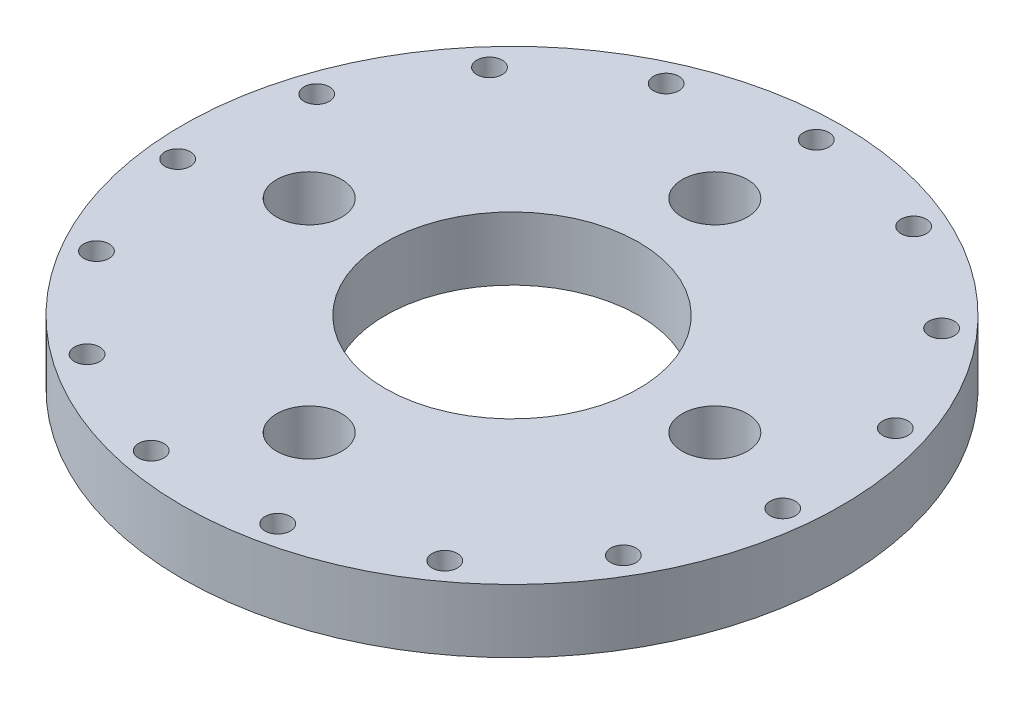
ISO-10303-21;
HEADER;
FILE_DESCRIPTION(('STEP AP214'),'2;1');
FILE_NAME('part.step','',(''),(''),'','','');
FILE_SCHEMA(('AUTOMOTIVE_DESIGN { 1 0 10303 214 1 1 1 1 }'));
ENDSEC;
DATA;
#1=APPLICATION_CONTEXT('core data for automotive mechanical design processes');
#2=APPLICATION_PROTOCOL_DEFINITION('international standard','automotive_design',2000,#1);
#3=PRODUCT_CONTEXT('',#1,'mechanical');
#4=PRODUCT('Part','Part','',(#3));
#5=PRODUCT_RELATED_PRODUCT_CATEGORY('part','',(#4));
#6=PRODUCT_DEFINITION_FORMATION('','',#4);
#7=PRODUCT_DEFINITION_CONTEXT('part definition',#1,'design');
#8=PRODUCT_DEFINITION('design','',#6,#7);
#9=PRODUCT_DEFINITION_SHAPE('','',#8);
#10=(LENGTH_UNIT() NAMED_UNIT(*) SI_UNIT(.MILLI.,.METRE.));
#11=(NAMED_UNIT(*) PLANE_ANGLE_UNIT() SI_UNIT($,.RADIAN.));
#12=(NAMED_UNIT(*) SI_UNIT($,.STERADIAN.) SOLID_ANGLE_UNIT());
#13=UNCERTAINTY_MEASURE_WITH_UNIT(LENGTH_MEASURE(1.E-05),#10,'distance_accuracy_value','');
#14=(GEOMETRIC_REPRESENTATION_CONTEXT(3) GLOBAL_UNCERTAINTY_ASSIGNED_CONTEXT((#13)) GLOBAL_UNIT_ASSIGNED_CONTEXT((#10,
#11,#12)) REPRESENTATION_CONTEXT('',''));
#15=CARTESIAN_POINT('',(0.,0.,0.));
#16=DIRECTION('',(0.,0.,1.));
#17=DIRECTION('',(1.,0.,0.));
#18=AXIS2_PLACEMENT_3D('',#15,#16,#17);
#19=CARTESIAN_POINT('',(0.,3.175,0.));
#20=DIRECTION('',(0.,1.,0.));
#21=DIRECTION('',(0.,0.,1.));
#22=AXIS2_PLACEMENT_3D('',#19,#20,#21);
#23=PLANE('',#22);
#24=CARTESIAN_POINT('',(6.19866644047502,3.175,-13.9224327744733));
#25=DIRECTION('',(0.,1.,0.));
#26=DIRECTION('',(-0.406736643075789,0.,0.913545457642606));
#27=AXIS2_PLACEMENT_3D('',#24,#25,#26);
#28=CIRCLE('',#27,0.635);
#29=CARTESIAN_POINT('',(5.9403886721219,3.175,-13.3423314088703));
#30=VERTEX_POINT('',#29);
#31=EDGE_CURVE('E158',#30,#30,#28,.T.);
#32=ORIENTED_EDGE('',*,*,#31,.F.);
#33=EDGE_LOOP('',(#32));
#34=FACE_BOUND('',#33,.T.);
#35=CARTESIAN_POINT('',(11.3255271402754,3.175,-10.1975504409091));
#36=DIRECTION('',(0.,1.,0.));
#37=DIRECTION('',(-0.743144825477386,0.,0.669130606358867));
#38=AXIS2_PLACEMENT_3D('',#35,#36,#37);
#39=CIRCLE('',#38,0.635);
#40=CARTESIAN_POINT('',(10.8536301760972,3.175,-9.77265250587125));
#41=VERTEX_POINT('',#40);
#42=EDGE_CURVE('E152',#41,#41,#39,.T.);
#43=ORIENTED_EDGE('',*,*,#42,.F.);
#44=EDGE_LOOP('',(#43));
#45=FACE_BOUND('',#44,.T.);
#46=CARTESIAN_POINT('',(14.4941013083381,3.175,-4.70941899427435));
#47=DIRECTION('',(0.,1.,0.));
#48=DIRECTION('',(-0.95105651629515,0.,0.309016994374957));
#49=AXIS2_PLACEMENT_3D('',#46,#47,#48);
#50=CIRCLE('',#49,0.635);
#51=CARTESIAN_POINT('',(13.8901804204907,3.175,-4.51319320284625));
#52=VERTEX_POINT('',#51);
#53=EDGE_CURVE('E146',#52,#52,#50,.T.);
#54=ORIENTED_EDGE('',*,*,#53,.F.);
#55=EDGE_LOOP('',(#54));
#56=FACE_BOUND('',#55,.T.);
#57=CARTESIAN_POINT('',(15.1565136854125,3.175,1.59301378019889));
#58=DIRECTION('',(0.,1.,0.));
#59=DIRECTION('',(-0.994521895368274,0.,-0.104528463267644));
#60=AXIS2_PLACEMENT_3D('',#57,#58,#59);
#61=CIRCLE('',#60,0.635);
#62=CARTESIAN_POINT('',(14.5249922818536,3.175,1.52663820602394));
#63=VERTEX_POINT('',#62);
#64=EDGE_CURVE('E140',#63,#63,#61,.T.);
#65=ORIENTED_EDGE('',*,*,#64,.F.);
#66=EDGE_LOOP('',(#65));
#67=FACE_BOUND('',#66,.T.);
#68=CARTESIAN_POINT('',(13.1982271536749,3.175,7.61999999999988));
#69=DIRECTION('',(0.,1.,0.));
#70=DIRECTION('',(-0.866025403784443,0.,-0.499999999999992));
#71=AXIS2_PLACEMENT_3D('',#68,#69,#70);
#72=CIRCLE('',#71,0.635);
#73=CARTESIAN_POINT('',(12.6483010222718,3.175,7.30249999999988));
#74=VERTEX_POINT('',#73);
#75=EDGE_CURVE('E134',#74,#74,#72,.T.);
#76=ORIENTED_EDGE('',*,*,#75,.F.);
#77=EDGE_LOOP('',(#76));
#78=FACE_BOUND('',#77,.T.);
#79=CARTESIAN_POINT('',(8.95784724493739,3.175,12.3294189942741));
#80=DIRECTION('',(0.,1.,0.));
#81=DIRECTION('',(-0.58778525229248,0.,-0.809016994374943));
#82=AXIS2_PLACEMENT_3D('',#79,#80,#81);
#83=CIRCLE('',#82,0.635);
#84=CARTESIAN_POINT('',(8.58460360973167,3.175,11.815693202846));
#85=VERTEX_POINT('',#84);
#86=EDGE_CURVE('E128',#85,#85,#83,.T.);
#87=ORIENTED_EDGE('',*,*,#86,.F.);
#88=EDGE_LOOP('',(#87));
#89=FACE_BOUND('',#88,.T.);
#90=CARTESIAN_POINT('',(3.16857416806276,3.175,14.9069694351832));
#91=DIRECTION('',(0.,1.,0.));
#92=DIRECTION('',(-0.207911690817766,0.,-0.978147600733804));
#93=AXIS2_PLACEMENT_3D('',#90,#91,#92);
#94=CIRCLE('',#93,0.635);
#95=CARTESIAN_POINT('',(3.03655024439348,3.175,14.2858457087172));
#96=VERTEX_POINT('',#95);
#97=EDGE_CURVE('E122',#96,#96,#94,.T.);
#98=ORIENTED_EDGE('',*,*,#97,.F.);
#99=EDGE_LOOP('',(#98));
#100=FACE_BOUND('',#99,.T.);
#101=CARTESIAN_POINT('',(-3.16857416806256,3.175,14.9069694351832));
#102=DIRECTION('',(0.,1.,0.));
#103=DIRECTION('',(0.207911690817753,0.,-0.978147600733807));
#104=AXIS2_PLACEMENT_3D('',#101,#102,#103);
#105=CIRCLE('',#104,0.635);
#106=CARTESIAN_POINT('',(-3.03655024439329,3.175,14.2858457087172));
#107=VERTEX_POINT('',#106);
#108=EDGE_CURVE('E116',#107,#107,#105,.T.);
#109=ORIENTED_EDGE('',*,*,#108,.F.);
#110=EDGE_LOOP('',(#109));
#111=FACE_BOUND('',#110,.T.);
#112=CARTESIAN_POINT('',(-8.95784724493723,3.175,12.3294189942742));
#113=DIRECTION('',(0.,1.,0.));
#114=DIRECTION('',(0.587785252292469,0.,-0.80901699437495));
#115=AXIS2_PLACEMENT_3D('',#112,#113,#114);
#116=CIRCLE('',#115,0.635);
#117=CARTESIAN_POINT('',(-8.58460360973151,3.175,11.8156932028461));
#118=VERTEX_POINT('',#117);
#119=EDGE_CURVE('E110',#118,#118,#116,.T.);
#120=ORIENTED_EDGE('',*,*,#119,.F.);
#121=EDGE_LOOP('',(#120));
#122=FACE_BOUND('',#121,.T.);
#123=CARTESIAN_POINT('',(-13.1982271536748,3.175,7.62000000000006));
#124=DIRECTION('',(0.,1.,0.));
#125=DIRECTION('',(0.866025403784436,0.,-0.500000000000004));
#126=AXIS2_PLACEMENT_3D('',#123,#124,#125);
#127=CIRCLE('',#126,0.635);
#128=CARTESIAN_POINT('',(-12.6483010222717,3.175,7.30250000000006));
#129=VERTEX_POINT('',#128);
#130=EDGE_CURVE('E104',#129,#129,#127,.T.);
#131=ORIENTED_EDGE('',*,*,#130,.F.);
#132=EDGE_LOOP('',(#131));
#133=FACE_BOUND('',#132,.T.);
#134=CARTESIAN_POINT('',(-15.1565136854125,3.175,1.59301378019909));
#135=DIRECTION('',(0.,1.,0.));
#136=DIRECTION('',(0.994521895368273,0.,-0.104528463267657));
#137=AXIS2_PLACEMENT_3D('',#134,#135,#136);
#138=CIRCLE('',#137,0.635);
#139=CARTESIAN_POINT('',(-14.5249922818536,3.175,1.52663820602413));
#140=VERTEX_POINT('',#139);
#141=EDGE_CURVE('E98',#140,#140,#138,.T.);
#142=ORIENTED_EDGE('',*,*,#141,.F.);
#143=EDGE_LOOP('',(#142));
#144=FACE_BOUND('',#143,.T.);
#145=CARTESIAN_POINT('',(-14.4941013083382,3.175,-4.70941899427416));
#146=DIRECTION('',(0.,1.,0.));
#147=DIRECTION('',(0.951056516295154,0.,0.309016994374945));
#148=AXIS2_PLACEMENT_3D('',#145,#146,#147);
#149=CIRCLE('',#148,0.635);
#150=CARTESIAN_POINT('',(-13.8901804204907,3.175,-4.51319320284607));
#151=VERTEX_POINT('',#150);
#152=EDGE_CURVE('E92',#151,#151,#149,.T.);
#153=ORIENTED_EDGE('',*,*,#152,.F.);
#154=EDGE_LOOP('',(#153));
#155=FACE_BOUND('',#154,.T.);
#156=CARTESIAN_POINT('',(-11.3255271402755,3.175,-10.197550440909));
#157=DIRECTION('',(0.,1.,0.));
#158=DIRECTION('',(0.743144825477395,0.,0.669130606358857));
#159=AXIS2_PLACEMENT_3D('',#156,#157,#158);
#160=CIRCLE('',#159,0.635);
#161=CARTESIAN_POINT('',(-10.8536301760974,3.175,-9.7726525058711));
#162=VERTEX_POINT('',#161);
#163=EDGE_CURVE('E86',#162,#162,#160,.T.);
#164=ORIENTED_EDGE('',*,*,#163,.F.);
#165=EDGE_LOOP('',(#164));
#166=FACE_BOUND('',#165,.T.);
#167=CARTESIAN_POINT('',(-6.19866644047521,3.175,-13.9224327744732));
#168=DIRECTION('',(0.,1.,0.));
#169=DIRECTION('',(0.406736643075801,0.,0.913545457642601));
#170=AXIS2_PLACEMENT_3D('',#167,#168,#169);
#171=CIRCLE('',#170,0.635);
#172=CARTESIAN_POINT('',(-5.94038867212207,3.175,-13.3423314088702));
#173=VERTEX_POINT('',#172);
#174=EDGE_CURVE('E80',#173,#173,#171,.T.);
#175=ORIENTED_EDGE('',*,*,#174,.F.);
#176=EDGE_LOOP('',(#175));
#177=FACE_BOUND('',#176,.T.);
#178=CARTESIAN_POINT('',(0.,3.175,-15.24));
#179=DIRECTION('',(0.,1.,0.));
#180=DIRECTION('',(0.,0.,1.));
#181=AXIS2_PLACEMENT_3D('',#178,#179,#180);
#182=CIRCLE('',#181,0.635);
#183=CARTESIAN_POINT('',(0.,3.175,-14.605));
#184=VERTEX_POINT('',#183);
#185=EDGE_CURVE('E74',#184,#184,#182,.T.);
#186=ORIENTED_EDGE('',*,*,#185,.F.);
#187=EDGE_LOOP('',(#186));
#188=FACE_BOUND('',#187,.T.);
#189=CARTESIAN_POINT('',(10.16,3.175,-1.06420351207939E-13));
#190=DIRECTION('',(0.,1.,0.));
#191=DIRECTION('',(0.,0.,1.));
#192=AXIS2_PLACEMENT_3D('',#189,#190,#191);
#193=CIRCLE('',#192,1.63194999999999);
#194=CARTESIAN_POINT('',(10.16,3.175,1.63194999999988));
#195=VERTEX_POINT('',#194);
#196=EDGE_CURVE('E70',#195,#195,#193,.T.);
#197=ORIENTED_EDGE('',*,*,#196,.F.);
#198=EDGE_LOOP('',(#197));
#199=FACE_BOUND('',#198,.T.);
#200=CARTESIAN_POINT('',(0.,3.175,10.16));
#201=DIRECTION('',(0.,1.,0.));
#202=DIRECTION('',(0.,0.,1.));
#203=AXIS2_PLACEMENT_3D('',#200,#201,#202);
#204=CIRCLE('',#203,1.63194999999999);
#205=CARTESIAN_POINT('',(0.,3.175,11.79195));
#206=VERTEX_POINT('',#205);
#207=EDGE_CURVE('E64',#206,#206,#204,.T.);
#208=ORIENTED_EDGE('',*,*,#207,.F.);
#209=EDGE_LOOP('',(#208));
#210=FACE_BOUND('',#209,.T.);
#211=CARTESIAN_POINT('',(-10.16,3.175,0.));
#212=DIRECTION('',(0.,1.,0.));
#213=DIRECTION('',(0.,0.,1.));
#214=AXIS2_PLACEMENT_3D('',#211,#212,#213);
#215=CIRCLE('',#214,1.63194999999999);
#216=CARTESIAN_POINT('',(-10.16,3.175,1.63195000000003));
#217=VERTEX_POINT('',#216);
#218=EDGE_CURVE('E58',#217,#217,#215,.T.);
#219=ORIENTED_EDGE('',*,*,#218,.F.);
#220=EDGE_LOOP('',(#219));
#221=FACE_BOUND('',#220,.T.);
#222=CARTESIAN_POINT('',(0.,3.175,-10.16));
#223=DIRECTION('',(0.,1.,0.));
#224=DIRECTION('',(0.,0.,1.));
#225=AXIS2_PLACEMENT_3D('',#222,#223,#224);
#226=CIRCLE('',#225,1.63194999999999);
#227=CARTESIAN_POINT('',(0.,3.175,-8.52805000000001));
#228=VERTEX_POINT('',#227);
#229=EDGE_CURVE('E52',#228,#228,#226,.T.);
#230=ORIENTED_EDGE('',*,*,#229,.F.);
#231=EDGE_LOOP('',(#230));
#232=FACE_BOUND('',#231,.T.);
#233=CARTESIAN_POINT('',(0.,3.175,0.));
#234=DIRECTION('',(0.,1.,0.));
#235=DIRECTION('',(0.,0.,1.));
#236=AXIS2_PLACEMENT_3D('',#233,#234,#235);
#237=CIRCLE('',#236,16.51);
#238=CARTESIAN_POINT('',(0.,3.175,16.51));
#239=VERTEX_POINT('',#238);
#240=EDGE_CURVE('E10',#239,#239,#237,.T.);
#241=ORIENTED_EDGE('',*,*,#240,.T.);
#242=EDGE_LOOP('',(#241));
#243=FACE_BOUND('',#242,.T.);
#244=CARTESIAN_POINT('',(0.,3.175,0.));
#245=DIRECTION('',(0.,1.,0.));
#246=DIRECTION('',(0.,0.,1.));
#247=AXIS2_PLACEMENT_3D('',#244,#245,#246);
#248=CIRCLE('',#247,6.35);
#249=CARTESIAN_POINT('',(0.,3.175,6.35));
#250=VERTEX_POINT('',#249);
#251=EDGE_CURVE('E42',#250,#250,#248,.T.);
#252=ORIENTED_EDGE('',*,*,#251,.F.);
#253=EDGE_LOOP('',(#252));
#254=FACE_BOUND('',#253,.T.);
#255=ADVANCED_FACE('F31',(#34,#45,#56,#67,#78,#89,#100,#111,#122,#133,#144,#155,#166,#177,#188,
#199,#210,#221,#232,#243,#254),#23,.T.);
#256=CARTESIAN_POINT('',(0.,0.,0.));
#257=DIRECTION('',(0.,1.,0.));
#258=DIRECTION('',(0.,0.,1.));
#259=AXIS2_PLACEMENT_3D('',#256,#257,#258);
#260=PLANE('',#259);
#261=CARTESIAN_POINT('',(6.19866644047502,0.,-13.9224327744733));
#262=DIRECTION('',(0.,1.,0.));
#263=DIRECTION('',(-0.406736643075789,0.,0.913545457642606));
#264=AXIS2_PLACEMENT_3D('',#261,#262,#263);
#265=CIRCLE('',#264,0.635);
#266=CARTESIAN_POINT('',(5.9403886721219,0.,-13.3423314088703));
#267=VERTEX_POINT('',#266);
#268=EDGE_CURVE('E155',#267,#267,#265,.T.);
#269=ORIENTED_EDGE('',*,*,#268,.T.);
#270=EDGE_LOOP('',(#269));
#271=FACE_BOUND('',#270,.T.);
#272=CARTESIAN_POINT('',(11.3255271402754,0.,-10.1975504409091));
#273=DIRECTION('',(0.,1.,0.));
#274=DIRECTION('',(-0.743144825477386,0.,0.669130606358867));
#275=AXIS2_PLACEMENT_3D('',#272,#273,#274);
#276=CIRCLE('',#275,0.635);
#277=CARTESIAN_POINT('',(10.8536301760972,0.,-9.77265250587125));
#278=VERTEX_POINT('',#277);
#279=EDGE_CURVE('E149',#278,#278,#276,.T.);
#280=ORIENTED_EDGE('',*,*,#279,.T.);
#281=EDGE_LOOP('',(#280));
#282=FACE_BOUND('',#281,.T.);
#283=CARTESIAN_POINT('',(14.4941013083381,0.,-4.70941899427435));
#284=DIRECTION('',(0.,1.,0.));
#285=DIRECTION('',(-0.95105651629515,0.,0.309016994374957));
#286=AXIS2_PLACEMENT_3D('',#283,#284,#285);
#287=CIRCLE('',#286,0.635);
#288=CARTESIAN_POINT('',(13.8901804204907,0.,-4.51319320284625));
#289=VERTEX_POINT('',#288);
#290=EDGE_CURVE('E143',#289,#289,#287,.T.);
#291=ORIENTED_EDGE('',*,*,#290,.T.);
#292=EDGE_LOOP('',(#291));
#293=FACE_BOUND('',#292,.T.);
#294=CARTESIAN_POINT('',(15.1565136854125,0.,1.59301378019889));
#295=DIRECTION('',(0.,1.,0.));
#296=DIRECTION('',(-0.994521895368274,0.,-0.104528463267644));
#297=AXIS2_PLACEMENT_3D('',#294,#295,#296);
#298=CIRCLE('',#297,0.635);
#299=CARTESIAN_POINT('',(14.5249922818536,0.,1.52663820602394));
#300=VERTEX_POINT('',#299);
#301=EDGE_CURVE('E137',#300,#300,#298,.T.);
#302=ORIENTED_EDGE('',*,*,#301,.T.);
#303=EDGE_LOOP('',(#302));
#304=FACE_BOUND('',#303,.T.);
#305=CARTESIAN_POINT('',(13.1982271536749,0.,7.61999999999988));
#306=DIRECTION('',(0.,1.,0.));
#307=DIRECTION('',(-0.866025403784443,0.,-0.499999999999992));
#308=AXIS2_PLACEMENT_3D('',#305,#306,#307);
#309=CIRCLE('',#308,0.635);
#310=CARTESIAN_POINT('',(12.6483010222718,0.,7.30249999999988));
#311=VERTEX_POINT('',#310);
#312=EDGE_CURVE('E131',#311,#311,#309,.T.);
#313=ORIENTED_EDGE('',*,*,#312,.T.);
#314=EDGE_LOOP('',(#313));
#315=FACE_BOUND('',#314,.T.);
#316=CARTESIAN_POINT('',(8.95784724493739,0.,12.3294189942741));
#317=DIRECTION('',(0.,1.,0.));
#318=DIRECTION('',(-0.58778525229248,0.,-0.809016994374943));
#319=AXIS2_PLACEMENT_3D('',#316,#317,#318);
#320=CIRCLE('',#319,0.635);
#321=CARTESIAN_POINT('',(8.58460360973167,0.,11.815693202846));
#322=VERTEX_POINT('',#321);
#323=EDGE_CURVE('E125',#322,#322,#320,.T.);
#324=ORIENTED_EDGE('',*,*,#323,.T.);
#325=EDGE_LOOP('',(#324));
#326=FACE_BOUND('',#325,.T.);
#327=CARTESIAN_POINT('',(3.16857416806276,0.,14.9069694351832));
#328=DIRECTION('',(0.,1.,0.));
#329=DIRECTION('',(-0.207911690817766,0.,-0.978147600733804));
#330=AXIS2_PLACEMENT_3D('',#327,#328,#329);
#331=CIRCLE('',#330,0.635);
#332=CARTESIAN_POINT('',(3.03655024439348,0.,14.2858457087172));
#333=VERTEX_POINT('',#332);
#334=EDGE_CURVE('E119',#333,#333,#331,.T.);
#335=ORIENTED_EDGE('',*,*,#334,.T.);
#336=EDGE_LOOP('',(#335));
#337=FACE_BOUND('',#336,.T.);
#338=CARTESIAN_POINT('',(-3.16857416806256,0.,14.9069694351832));
#339=DIRECTION('',(0.,1.,0.));
#340=DIRECTION('',(0.207911690817753,0.,-0.978147600733807));
#341=AXIS2_PLACEMENT_3D('',#338,#339,#340);
#342=CIRCLE('',#341,0.635);
#343=CARTESIAN_POINT('',(-3.03655024439329,0.,14.2858457087172));
#344=VERTEX_POINT('',#343);
#345=EDGE_CURVE('E113',#344,#344,#342,.T.);
#346=ORIENTED_EDGE('',*,*,#345,.T.);
#347=EDGE_LOOP('',(#346));
#348=FACE_BOUND('',#347,.T.);
#349=CARTESIAN_POINT('',(-8.95784724493723,0.,12.3294189942742));
#350=DIRECTION('',(0.,1.,0.));
#351=DIRECTION('',(0.587785252292469,0.,-0.80901699437495));
#352=AXIS2_PLACEMENT_3D('',#349,#350,#351);
#353=CIRCLE('',#352,0.635);
#354=CARTESIAN_POINT('',(-8.58460360973151,0.,11.8156932028461));
#355=VERTEX_POINT('',#354);
#356=EDGE_CURVE('E107',#355,#355,#353,.T.);
#357=ORIENTED_EDGE('',*,*,#356,.T.);
#358=EDGE_LOOP('',(#357));
#359=FACE_BOUND('',#358,.T.);
#360=CARTESIAN_POINT('',(-13.1982271536748,0.,7.62000000000006));
#361=DIRECTION('',(0.,1.,0.));
#362=DIRECTION('',(0.866025403784436,0.,-0.500000000000004));
#363=AXIS2_PLACEMENT_3D('',#360,#361,#362);
#364=CIRCLE('',#363,0.635);
#365=CARTESIAN_POINT('',(-12.6483010222717,0.,7.30250000000006));
#366=VERTEX_POINT('',#365);
#367=EDGE_CURVE('E101',#366,#366,#364,.T.);
#368=ORIENTED_EDGE('',*,*,#367,.T.);
#369=EDGE_LOOP('',(#368));
#370=FACE_BOUND('',#369,.T.);
#371=CARTESIAN_POINT('',(-15.1565136854125,0.,1.59301378019909));
#372=DIRECTION('',(0.,1.,0.));
#373=DIRECTION('',(0.994521895368273,0.,-0.104528463267657));
#374=AXIS2_PLACEMENT_3D('',#371,#372,#373);
#375=CIRCLE('',#374,0.635);
#376=CARTESIAN_POINT('',(-14.5249922818536,0.,1.52663820602413));
#377=VERTEX_POINT('',#376);
#378=EDGE_CURVE('E95',#377,#377,#375,.T.);
#379=ORIENTED_EDGE('',*,*,#378,.T.);
#380=EDGE_LOOP('',(#379));
#381=FACE_BOUND('',#380,.T.);
#382=CARTESIAN_POINT('',(-14.4941013083382,0.,-4.70941899427416));
#383=DIRECTION('',(0.,1.,0.));
#384=DIRECTION('',(0.951056516295154,0.,0.309016994374945));
#385=AXIS2_PLACEMENT_3D('',#382,#383,#384);
#386=CIRCLE('',#385,0.635);
#387=CARTESIAN_POINT('',(-13.8901804204907,0.,-4.51319320284607));
#388=VERTEX_POINT('',#387);
#389=EDGE_CURVE('E89',#388,#388,#386,.T.);
#390=ORIENTED_EDGE('',*,*,#389,.T.);
#391=EDGE_LOOP('',(#390));
#392=FACE_BOUND('',#391,.T.);
#393=CARTESIAN_POINT('',(-11.3255271402755,0.,-10.197550440909));
#394=DIRECTION('',(0.,1.,0.));
#395=DIRECTION('',(0.743144825477395,0.,0.669130606358857));
#396=AXIS2_PLACEMENT_3D('',#393,#394,#395);
#397=CIRCLE('',#396,0.635);
#398=CARTESIAN_POINT('',(-10.8536301760974,0.,-9.7726525058711));
#399=VERTEX_POINT('',#398);
#400=EDGE_CURVE('E83',#399,#399,#397,.T.);
#401=ORIENTED_EDGE('',*,*,#400,.T.);
#402=EDGE_LOOP('',(#401));
#403=FACE_BOUND('',#402,.T.);
#404=CARTESIAN_POINT('',(-6.19866644047521,0.,-13.9224327744732));
#405=DIRECTION('',(0.,1.,0.));
#406=DIRECTION('',(0.406736643075801,0.,0.913545457642601));
#407=AXIS2_PLACEMENT_3D('',#404,#405,#406);
#408=CIRCLE('',#407,0.635);
#409=CARTESIAN_POINT('',(-5.94038867212207,0.,-13.3423314088702));
#410=VERTEX_POINT('',#409);
#411=EDGE_CURVE('E77',#410,#410,#408,.T.);
#412=ORIENTED_EDGE('',*,*,#411,.T.);
#413=EDGE_LOOP('',(#412));
#414=FACE_BOUND('',#413,.T.);
#415=CARTESIAN_POINT('',(0.,0.,-15.24));
#416=DIRECTION('',(0.,1.,0.));
#417=DIRECTION('',(0.,0.,1.));
#418=AXIS2_PLACEMENT_3D('',#415,#416,#417);
#419=CIRCLE('',#418,0.635);
#420=CARTESIAN_POINT('',(0.,0.,-14.605));
#421=VERTEX_POINT('',#420);
#422=EDGE_CURVE('E73',#421,#421,#419,.T.);
#423=ORIENTED_EDGE('',*,*,#422,.T.);
#424=EDGE_LOOP('',(#423));
#425=FACE_BOUND('',#424,.T.);
#426=CARTESIAN_POINT('',(10.16,0.,-1.06420351207939E-13));
#427=DIRECTION('',(0.,1.,0.));
#428=DIRECTION('',(0.,0.,1.));
#429=AXIS2_PLACEMENT_3D('',#426,#427,#428);
#430=CIRCLE('',#429,1.63194999999999);
#431=CARTESIAN_POINT('',(10.16,0.,1.63194999999988));
#432=VERTEX_POINT('',#431);
#433=EDGE_CURVE('E67',#432,#432,#430,.T.);
#434=ORIENTED_EDGE('',*,*,#433,.T.);
#435=EDGE_LOOP('',(#434));
#436=FACE_BOUND('',#435,.T.);
#437=CARTESIAN_POINT('',(0.,0.,10.16));
#438=DIRECTION('',(0.,1.,0.));
#439=DIRECTION('',(0.,0.,1.));
#440=AXIS2_PLACEMENT_3D('',#437,#438,#439);
#441=CIRCLE('',#440,1.63194999999999);
#442=CARTESIAN_POINT('',(0.,0.,11.79195));
#443=VERTEX_POINT('',#442);
#444=EDGE_CURVE('E61',#443,#443,#441,.T.);
#445=ORIENTED_EDGE('',*,*,#444,.T.);
#446=EDGE_LOOP('',(#445));
#447=FACE_BOUND('',#446,.T.);
#448=CARTESIAN_POINT('',(-10.16,0.,0.));
#449=DIRECTION('',(0.,1.,0.));
#450=DIRECTION('',(0.,0.,1.));
#451=AXIS2_PLACEMENT_3D('',#448,#449,#450);
#452=CIRCLE('',#451,1.63194999999999);
#453=CARTESIAN_POINT('',(-10.16,0.,1.63195000000002));
#454=VERTEX_POINT('',#453);
#455=EDGE_CURVE('E55',#454,#454,#452,.T.);
#456=ORIENTED_EDGE('',*,*,#455,.T.);
#457=EDGE_LOOP('',(#456));
#458=FACE_BOUND('',#457,.T.);
#459=CARTESIAN_POINT('',(0.,0.,-10.16));
#460=DIRECTION('',(0.,1.,0.));
#461=DIRECTION('',(0.,0.,1.));
#462=AXIS2_PLACEMENT_3D('',#459,#460,#461);
#463=CIRCLE('',#462,1.63194999999999);
#464=CARTESIAN_POINT('',(0.,0.,-8.52805000000001));
#465=VERTEX_POINT('',#464);
#466=EDGE_CURVE('E47',#465,#465,#463,.T.);
#467=ORIENTED_EDGE('',*,*,#466,.T.);
#468=EDGE_LOOP('',(#467));
#469=FACE_BOUND('',#468,.T.);
#470=CARTESIAN_POINT('',(0.,0.,0.));
#471=DIRECTION('',(0.,1.,0.));
#472=DIRECTION('',(0.,0.,1.));
#473=AXIS2_PLACEMENT_3D('',#470,#471,#472);
#474=CIRCLE('',#473,16.51);
#475=CARTESIAN_POINT('',(0.,0.,16.51));
#476=VERTEX_POINT('',#475);
#477=EDGE_CURVE('E35',#476,#476,#474,.T.);
#478=ORIENTED_EDGE('',*,*,#477,.F.);
#479=EDGE_LOOP('',(#478));
#480=FACE_BOUND('',#479,.T.);
#481=CARTESIAN_POINT('',(0.,0.,0.));
#482=DIRECTION('',(0.,1.,0.));
#483=DIRECTION('',(0.,0.,1.));
#484=AXIS2_PLACEMENT_3D('',#481,#482,#483);
#485=CIRCLE('',#484,6.35);
#486=CARTESIAN_POINT('',(0.,0.,6.35));
#487=VERTEX_POINT('',#486);
#488=EDGE_CURVE('E44',#487,#487,#485,.T.);
#489=ORIENTED_EDGE('',*,*,#488,.T.);
#490=EDGE_LOOP('',(#489));
#491=FACE_BOUND('',#490,.T.);
#492=ADVANCED_FACE('F164',(#271,#282,#293,#304,#315,#326,#337,#348,#359,#370,#381,#392,#403,
#414,#425,#436,#447,#458,#469,#480,#491),#260,.F.);
#493=CARTESIAN_POINT('',(0.,3.175,0.));
#494=DIRECTION('',(0.,-1.,0.));
#495=DIRECTION('',(0.,0.,-1.));
#496=AXIS2_PLACEMENT_3D('',#493,#494,#495);
#497=CYLINDRICAL_SURFACE('',#496,16.51);
#498=ORIENTED_EDGE('',*,*,#240,.F.);
#499=EDGE_LOOP('',(#498));
#500=FACE_BOUND('',#499,.T.);
#501=ORIENTED_EDGE('',*,*,#477,.T.);
#502=EDGE_LOOP('',(#501));
#503=FACE_BOUND('',#502,.T.);
#504=ADVANCED_FACE('F33',(#500,#503),#497,.T.);
#505=CARTESIAN_POINT('',(0.,3.175,0.));
#506=DIRECTION('',(0.,-1.,0.));
#507=DIRECTION('',(0.,0.,-1.));
#508=AXIS2_PLACEMENT_3D('',#505,#506,#507);
#509=CYLINDRICAL_SURFACE('',#508,6.35);
#510=ORIENTED_EDGE('',*,*,#251,.T.);
#511=EDGE_LOOP('',(#510));
#512=FACE_BOUND('',#511,.T.);
#513=ORIENTED_EDGE('',*,*,#488,.F.);
#514=EDGE_LOOP('',(#513));
#515=FACE_BOUND('',#514,.T.);
#516=ADVANCED_FACE('F215',(#512,#515),#509,.F.);
#517=CARTESIAN_POINT('',(0.,3.175,-10.16));
#518=DIRECTION('',(0.,1.,0.));
#519=DIRECTION('',(0.,0.,1.));
#520=AXIS2_PLACEMENT_3D('',#517,#518,#519);
#521=CYLINDRICAL_SURFACE('',#520,1.63194999999999);
#522=ORIENTED_EDGE('',*,*,#229,.T.);
#523=EDGE_LOOP('',(#522));
#524=FACE_BOUND('',#523,.T.);
#525=ORIENTED_EDGE('',*,*,#466,.F.);
#526=EDGE_LOOP('',(#525));
#527=FACE_BOUND('',#526,.T.);
#528=ADVANCED_FACE('F218',(#524,#527),#521,.F.);
#529=CARTESIAN_POINT('',(-10.16,3.175,0.));
#530=DIRECTION('',(0.,1.,0.));
#531=DIRECTION('',(0.,0.,1.));
#532=AXIS2_PLACEMENT_3D('',#529,#530,#531);
#533=CYLINDRICAL_SURFACE('',#532,1.63194999999999);
#534=ORIENTED_EDGE('',*,*,#218,.T.);
#535=EDGE_LOOP('',(#534));
#536=FACE_BOUND('',#535,.T.);
#537=ORIENTED_EDGE('',*,*,#455,.F.);
#538=EDGE_LOOP('',(#537));
#539=FACE_BOUND('',#538,.T.);
#540=ADVANCED_FACE('F230',(#536,#539),#533,.F.);
#541=CARTESIAN_POINT('',(0.,3.175,10.16));
#542=DIRECTION('',(0.,1.,0.));
#543=DIRECTION('',(0.,0.,1.));
#544=AXIS2_PLACEMENT_3D('',#541,#542,#543);
#545=CYLINDRICAL_SURFACE('',#544,1.63194999999999);
#546=ORIENTED_EDGE('',*,*,#207,.T.);
#547=EDGE_LOOP('',(#546));
#548=FACE_BOUND('',#547,.T.);
#549=ORIENTED_EDGE('',*,*,#444,.F.);
#550=EDGE_LOOP('',(#549));
#551=FACE_BOUND('',#550,.T.);
#552=ADVANCED_FACE('F234',(#548,#551),#545,.F.);
#553=CARTESIAN_POINT('',(10.16,3.175,-1.06420351207939E-13));
#554=DIRECTION('',(0.,1.,0.));
#555=DIRECTION('',(0.,0.,1.));
#556=AXIS2_PLACEMENT_3D('',#553,#554,#555);
#557=CYLINDRICAL_SURFACE('',#556,1.63194999999999);
#558=ORIENTED_EDGE('',*,*,#196,.T.);
#559=EDGE_LOOP('',(#558));
#560=FACE_BOUND('',#559,.T.);
#561=ORIENTED_EDGE('',*,*,#433,.F.);
#562=EDGE_LOOP('',(#561));
#563=FACE_BOUND('',#562,.T.);
#564=ADVANCED_FACE('F238',(#560,#563),#557,.F.);
#565=CARTESIAN_POINT('',(0.,0.,-15.24));
#566=DIRECTION('',(0.,1.,0.));
#567=DIRECTION('',(0.,0.,1.));
#568=AXIS2_PLACEMENT_3D('',#565,#566,#567);
#569=CYLINDRICAL_SURFACE('',#568,0.635);
#570=ORIENTED_EDGE('',*,*,#422,.F.);
#571=EDGE_LOOP('',(#570));
#572=FACE_BOUND('',#571,.T.);
#573=ORIENTED_EDGE('',*,*,#185,.T.);
#574=EDGE_LOOP('',(#573));
#575=FACE_BOUND('',#574,.T.);
#576=ADVANCED_FACE('F242',(#572,#575),#569,.F.);
#577=CARTESIAN_POINT('',(-6.19866644047521,0.,-13.9224327744732));
#578=DIRECTION('',(0.,1.,0.));
#579=DIRECTION('',(0.,0.,1.));
#580=AXIS2_PLACEMENT_3D('',#577,#578,#579);
#581=CYLINDRICAL_SURFACE('',#580,0.635);
#582=ORIENTED_EDGE('',*,*,#411,.F.);
#583=EDGE_LOOP('',(#582));
#584=FACE_BOUND('',#583,.T.);
#585=ORIENTED_EDGE('',*,*,#174,.T.);
#586=EDGE_LOOP('',(#585));
#587=FACE_BOUND('',#586,.T.);
#588=ADVANCED_FACE('F246',(#584,#587),#581,.F.);
#589=CARTESIAN_POINT('',(-11.3255271402755,0.,-10.197550440909));
#590=DIRECTION('',(0.,1.,0.));
#591=DIRECTION('',(0.,0.,1.));
#592=AXIS2_PLACEMENT_3D('',#589,#590,#591);
#593=CYLINDRICAL_SURFACE('',#592,0.635);
#594=ORIENTED_EDGE('',*,*,#400,.F.);
#595=EDGE_LOOP('',(#594));
#596=FACE_BOUND('',#595,.T.);
#597=ORIENTED_EDGE('',*,*,#163,.T.);
#598=EDGE_LOOP('',(#597));
#599=FACE_BOUND('',#598,.T.);
#600=ADVANCED_FACE('F250',(#596,#599),#593,.F.);
#601=CARTESIAN_POINT('',(-14.4941013083382,0.,-4.70941899427416));
#602=DIRECTION('',(0.,1.,0.));
#603=DIRECTION('',(0.,0.,1.));
#604=AXIS2_PLACEMENT_3D('',#601,#602,#603);
#605=CYLINDRICAL_SURFACE('',#604,0.635);
#606=ORIENTED_EDGE('',*,*,#389,.F.);
#607=EDGE_LOOP('',(#606));
#608=FACE_BOUND('',#607,.T.);
#609=ORIENTED_EDGE('',*,*,#152,.T.);
#610=EDGE_LOOP('',(#609));
#611=FACE_BOUND('',#610,.T.);
#612=ADVANCED_FACE('F254',(#608,#611),#605,.F.);
#613=CARTESIAN_POINT('',(-15.1565136854125,0.,1.59301378019909));
#614=DIRECTION('',(0.,1.,0.));
#615=DIRECTION('',(0.,0.,1.));
#616=AXIS2_PLACEMENT_3D('',#613,#614,#615);
#617=CYLINDRICAL_SURFACE('',#616,0.635);
#618=ORIENTED_EDGE('',*,*,#378,.F.);
#619=EDGE_LOOP('',(#618));
#620=FACE_BOUND('',#619,.T.);
#621=ORIENTED_EDGE('',*,*,#141,.T.);
#622=EDGE_LOOP('',(#621));
#623=FACE_BOUND('',#622,.T.);
#624=ADVANCED_FACE('F258',(#620,#623),#617,.F.);
#625=CARTESIAN_POINT('',(-13.1982271536748,0.,7.62000000000006));
#626=DIRECTION('',(0.,1.,0.));
#627=DIRECTION('',(0.,0.,1.));
#628=AXIS2_PLACEMENT_3D('',#625,#626,#627);
#629=CYLINDRICAL_SURFACE('',#628,0.635);
#630=ORIENTED_EDGE('',*,*,#367,.F.);
#631=EDGE_LOOP('',(#630));
#632=FACE_BOUND('',#631,.T.);
#633=ORIENTED_EDGE('',*,*,#130,.T.);
#634=EDGE_LOOP('',(#633));
#635=FACE_BOUND('',#634,.T.);
#636=ADVANCED_FACE('F262',(#632,#635),#629,.F.);
#637=CARTESIAN_POINT('',(-8.95784724493723,0.,12.3294189942742));
#638=DIRECTION('',(0.,1.,0.));
#639=DIRECTION('',(0.,0.,1.));
#640=AXIS2_PLACEMENT_3D('',#637,#638,#639);
#641=CYLINDRICAL_SURFACE('',#640,0.635);
#642=ORIENTED_EDGE('',*,*,#356,.F.);
#643=EDGE_LOOP('',(#642));
#644=FACE_BOUND('',#643,.T.);
#645=ORIENTED_EDGE('',*,*,#119,.T.);
#646=EDGE_LOOP('',(#645));
#647=FACE_BOUND('',#646,.T.);
#648=ADVANCED_FACE('F266',(#644,#647),#641,.F.);
#649=CARTESIAN_POINT('',(-3.16857416806256,0.,14.9069694351832));
#650=DIRECTION('',(0.,1.,0.));
#651=DIRECTION('',(0.,0.,1.));
#652=AXIS2_PLACEMENT_3D('',#649,#650,#651);
#653=CYLINDRICAL_SURFACE('',#652,0.635);
#654=ORIENTED_EDGE('',*,*,#345,.F.);
#655=EDGE_LOOP('',(#654));
#656=FACE_BOUND('',#655,.T.);
#657=ORIENTED_EDGE('',*,*,#108,.T.);
#658=EDGE_LOOP('',(#657));
#659=FACE_BOUND('',#658,.T.);
#660=ADVANCED_FACE('F270',(#656,#659),#653,.F.);
#661=CARTESIAN_POINT('',(3.16857416806276,0.,14.9069694351832));
#662=DIRECTION('',(0.,1.,0.));
#663=DIRECTION('',(0.,0.,1.));
#664=AXIS2_PLACEMENT_3D('',#661,#662,#663);
#665=CYLINDRICAL_SURFACE('',#664,0.635);
#666=ORIENTED_EDGE('',*,*,#334,.F.);
#667=EDGE_LOOP('',(#666));
#668=FACE_BOUND('',#667,.T.);
#669=ORIENTED_EDGE('',*,*,#97,.T.);
#670=EDGE_LOOP('',(#669));
#671=FACE_BOUND('',#670,.T.);
#672=ADVANCED_FACE('F274',(#668,#671),#665,.F.);
#673=CARTESIAN_POINT('',(8.95784724493739,0.,12.3294189942741));
#674=DIRECTION('',(0.,1.,0.));
#675=DIRECTION('',(0.,0.,1.));
#676=AXIS2_PLACEMENT_3D('',#673,#674,#675);
#677=CYLINDRICAL_SURFACE('',#676,0.635);
#678=ORIENTED_EDGE('',*,*,#323,.F.);
#679=EDGE_LOOP('',(#678));
#680=FACE_BOUND('',#679,.T.);
#681=ORIENTED_EDGE('',*,*,#86,.T.);
#682=EDGE_LOOP('',(#681));
#683=FACE_BOUND('',#682,.T.);
#684=ADVANCED_FACE('F278',(#680,#683),#677,.F.);
#685=CARTESIAN_POINT('',(13.1982271536749,0.,7.61999999999988));
#686=DIRECTION('',(0.,1.,0.));
#687=DIRECTION('',(0.,0.,1.));
#688=AXIS2_PLACEMENT_3D('',#685,#686,#687);
#689=CYLINDRICAL_SURFACE('',#688,0.635);
#690=ORIENTED_EDGE('',*,*,#312,.F.);
#691=EDGE_LOOP('',(#690));
#692=FACE_BOUND('',#691,.T.);
#693=ORIENTED_EDGE('',*,*,#75,.T.);
#694=EDGE_LOOP('',(#693));
#695=FACE_BOUND('',#694,.T.);
#696=ADVANCED_FACE('F282',(#692,#695),#689,.F.);
#697=CARTESIAN_POINT('',(15.1565136854125,0.,1.59301378019889));
#698=DIRECTION('',(0.,1.,0.));
#699=DIRECTION('',(0.,0.,1.));
#700=AXIS2_PLACEMENT_3D('',#697,#698,#699);
#701=CYLINDRICAL_SURFACE('',#700,0.635);
#702=ORIENTED_EDGE('',*,*,#301,.F.);
#703=EDGE_LOOP('',(#702));
#704=FACE_BOUND('',#703,.T.);
#705=ORIENTED_EDGE('',*,*,#64,.T.);
#706=EDGE_LOOP('',(#705));
#707=FACE_BOUND('',#706,.T.);
#708=ADVANCED_FACE('F286',(#704,#707),#701,.F.);
#709=CARTESIAN_POINT('',(14.4941013083381,0.,-4.70941899427435));
#710=DIRECTION('',(0.,1.,0.));
#711=DIRECTION('',(0.,0.,1.));
#712=AXIS2_PLACEMENT_3D('',#709,#710,#711);
#713=CYLINDRICAL_SURFACE('',#712,0.635);
#714=ORIENTED_EDGE('',*,*,#290,.F.);
#715=EDGE_LOOP('',(#714));
#716=FACE_BOUND('',#715,.T.);
#717=ORIENTED_EDGE('',*,*,#53,.T.);
#718=EDGE_LOOP('',(#717));
#719=FACE_BOUND('',#718,.T.);
#720=ADVANCED_FACE('F290',(#716,#719),#713,.F.);
#721=CARTESIAN_POINT('',(11.3255271402754,0.,-10.1975504409091));
#722=DIRECTION('',(0.,1.,0.));
#723=DIRECTION('',(0.,0.,1.));
#724=AXIS2_PLACEMENT_3D('',#721,#722,#723);
#725=CYLINDRICAL_SURFACE('',#724,0.635);
#726=ORIENTED_EDGE('',*,*,#279,.F.);
#727=EDGE_LOOP('',(#726));
#728=FACE_BOUND('',#727,.T.);
#729=ORIENTED_EDGE('',*,*,#42,.T.);
#730=EDGE_LOOP('',(#729));
#731=FACE_BOUND('',#730,.T.);
#732=ADVANCED_FACE('F170',(#728,#731),#725,.F.);
#733=CARTESIAN_POINT('',(6.19866644047502,0.,-13.9224327744733));
#734=DIRECTION('',(0.,1.,0.));
#735=DIRECTION('',(0.,0.,1.));
#736=AXIS2_PLACEMENT_3D('',#733,#734,#735);
#737=CYLINDRICAL_SURFACE('',#736,0.635);
#738=ORIENTED_EDGE('',*,*,#268,.F.);
#739=EDGE_LOOP('',(#738));
#740=FACE_BOUND('',#739,.T.);
#741=ORIENTED_EDGE('',*,*,#31,.T.);
#742=EDGE_LOOP('',(#741));
#743=FACE_BOUND('',#742,.T.);
#744=ADVANCED_FACE('F167',(#740,#743),#737,.F.);
#745=CLOSED_SHELL('',(#255,#492,#504,#516,#528,#540,#552,#564,#576,#588,#600,#612,#624,#636,
#648,#660,#672,#684,#696,#708,#720,#732,#744));
#746=MANIFOLD_SOLID_BREP('B2',#745);
#747=ADVANCED_BREP_SHAPE_REPRESENTATION('',(#18,#746),#14);
#748=SHAPE_DEFINITION_REPRESENTATION(#9,#747);
ENDSEC;
END-ISO-10303-21;
